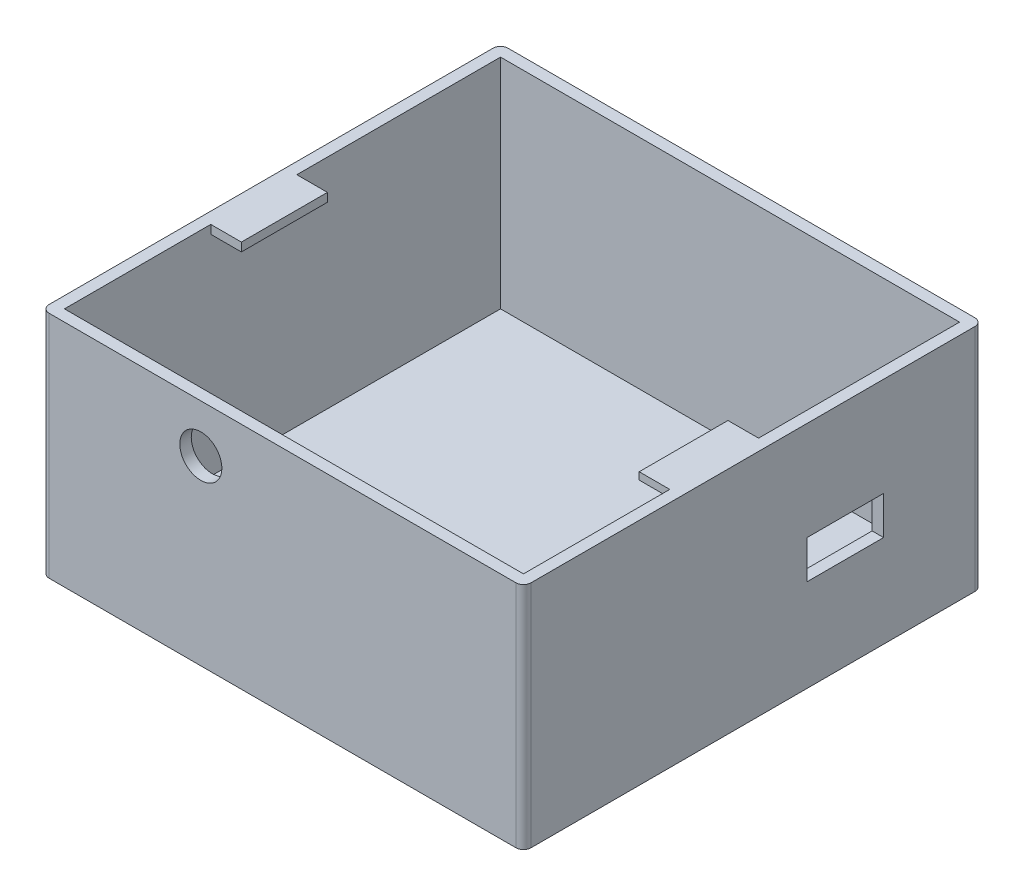
ISO-10303-21;
HEADER;
FILE_DESCRIPTION(('STEP AP214'),'2;1');
FILE_NAME('part.step','',(''),(''),'','','');
FILE_SCHEMA(('AUTOMOTIVE_DESIGN { 1 0 10303 214 1 1 1 1 }'));
ENDSEC;
DATA;
#1=APPLICATION_CONTEXT('core data for automotive mechanical design processes');
#2=APPLICATION_PROTOCOL_DEFINITION('international standard','automotive_design',2000,#1);
#3=PRODUCT_CONTEXT('',#1,'mechanical');
#4=PRODUCT('Part','Part','',(#3));
#5=PRODUCT_RELATED_PRODUCT_CATEGORY('part','',(#4));
#6=PRODUCT_DEFINITION_FORMATION('','',#4);
#7=PRODUCT_DEFINITION_CONTEXT('part definition',#1,'design');
#8=PRODUCT_DEFINITION('design','',#6,#7);
#9=PRODUCT_DEFINITION_SHAPE('','',#8);
#10=(LENGTH_UNIT() NAMED_UNIT(*) SI_UNIT(.MILLI.,.METRE.));
#11=(NAMED_UNIT(*) PLANE_ANGLE_UNIT() SI_UNIT($,.RADIAN.));
#12=(NAMED_UNIT(*) SI_UNIT($,.STERADIAN.) SOLID_ANGLE_UNIT());
#13=UNCERTAINTY_MEASURE_WITH_UNIT(LENGTH_MEASURE(1.E-05),#10,'distance_accuracy_value','');
#14=(GEOMETRIC_REPRESENTATION_CONTEXT(3) GLOBAL_UNCERTAINTY_ASSIGNED_CONTEXT((#13)) GLOBAL_UNIT_ASSIGNED_CONTEXT((#10,
#11,#12)) REPRESENTATION_CONTEXT('',''));
#15=CARTESIAN_POINT('',(0.,0.,0.));
#16=DIRECTION('',(0.,0.,1.));
#17=DIRECTION('',(1.,0.,0.));
#18=AXIS2_PLACEMENT_3D('',#15,#16,#17);
#19=CARTESIAN_POINT('',(38.2849462365592,44.,31.2060931899642));
#20=DIRECTION('',(-1.,0.,0.));
#21=DIRECTION('',(0.,0.,1.));
#22=AXIS2_PLACEMENT_3D('',#19,#20,#21);
#23=PLANE('',#22);
#24=DIRECTION('',(0.,-1.,0.));
#25=VECTOR('',#24,1.);
#26=CARTESIAN_POINT('',(38.2849462365592,44.,-14.3634183953));
#27=LINE('',#26,#25);
#28=CARTESIAN_POINT('',(38.2849462365592,17.0774927134322,-14.3634183953));
#29=VERTEX_POINT('',#28);
#30=CARTESIAN_POINT('',(38.2849462365592,12.0774927134322,-14.3634183953));
#31=VERTEX_POINT('',#30);
#32=EDGE_CURVE('E262',#29,#31,#27,.T.);
#33=ORIENTED_EDGE('',*,*,#32,.F.);
#34=DIRECTION('',(0.,0.,-1.));
#35=VECTOR('',#34,1.);
#36=CARTESIAN_POINT('',(38.2849462365592,17.0774927134322,31.2060931899641));
#37=LINE('',#36,#35);
#38=CARTESIAN_POINT('',(38.2849462365592,17.0774927134322,-4.36341839530005));
#39=VERTEX_POINT('',#38);
#40=EDGE_CURVE('E250',#39,#29,#37,.T.);
#41=ORIENTED_EDGE('',*,*,#40,.F.);
#42=DIRECTION('',(0.,1.,0.));
#43=VECTOR('',#42,1.);
#44=CARTESIAN_POINT('',(38.2849462365592,44.,-4.36341839530004));
#45=LINE('',#44,#43);
#46=CARTESIAN_POINT('',(38.2849462365592,12.0774927134322,-4.36341839530005));
#47=VERTEX_POINT('',#46);
#48=EDGE_CURVE('E225',#47,#39,#45,.T.);
#49=ORIENTED_EDGE('',*,*,#48,.F.);
#50=DIRECTION('',(0.,0.,1.));
#51=VECTOR('',#50,1.);
#52=CARTESIAN_POINT('',(38.2849462365592,12.0774927134322,31.2060931899641));
#53=LINE('',#52,#51);
#54=EDGE_CURVE('E259',#31,#47,#53,.T.);
#55=ORIENTED_EDGE('',*,*,#54,.F.);
#56=EDGE_LOOP('',(#33,#41,#49,#55));
#57=FACE_BOUND('',#56,.T.);
#58=DIRECTION('',(0.,-1.,0.));
#59=VECTOR('',#58,1.);
#60=CARTESIAN_POINT('',(38.2849462365592,44.,-25.7939068100358));
#61=LINE('',#60,#59);
#62=CARTESIAN_POINT('',(38.2849462365592,30.,-25.7939068100358));
#63=VERTEX_POINT('',#62);
#64=CARTESIAN_POINT('',(38.2849462365592,1.5,-25.7939068100358));
#65=VERTEX_POINT('',#64);
#66=EDGE_CURVE('E377',#63,#65,#61,.T.);
#67=ORIENTED_EDGE('',*,*,#66,.T.);
#68=DIRECTION('',(0.,0.,-1.));
#69=VECTOR('',#68,1.);
#70=CARTESIAN_POINT('',(38.2849462365592,1.5,26.2060931899642));
#71=LINE('',#70,#69);
#72=CARTESIAN_POINT('',(38.2849462365592,1.5,26.2060931899642));
#73=VERTEX_POINT('',#72);
#74=EDGE_CURVE('E289',#73,#65,#71,.T.);
#75=ORIENTED_EDGE('',*,*,#74,.F.);
#76=DIRECTION('',(0.,1.,0.));
#77=VECTOR('',#76,1.);
#78=CARTESIAN_POINT('',(38.2849462365592,0.,26.2060931899642));
#79=LINE('',#78,#77);
#80=CARTESIAN_POINT('',(38.2849462365592,0.,26.2060931899642));
#81=VERTEX_POINT('',#80);
#82=EDGE_CURVE('E270',#81,#73,#79,.T.);
#83=ORIENTED_EDGE('',*,*,#82,.F.);
#84=DIRECTION('',(0.,0.,-1.));
#85=VECTOR('',#84,1.);
#86=CARTESIAN_POINT('',(38.2849462365592,0.,31.2060931899642));
#87=LINE('',#86,#85);
#88=CARTESIAN_POINT('',(38.2849462365592,0.,31.2060931899642));
#89=VERTEX_POINT('',#88);
#90=EDGE_CURVE('E373',#89,#81,#87,.T.);
#91=ORIENTED_EDGE('',*,*,#90,.F.);
#92=DIRECTION('',(0.,-1.,0.));
#93=VECTOR('',#92,1.);
#94=CARTESIAN_POINT('',(38.2849462365592,44.,31.2060931899642));
#95=LINE('',#94,#93);
#96=CARTESIAN_POINT('',(38.2849462365592,30.,31.2060931899642));
#97=VERTEX_POINT('',#96);
#98=EDGE_CURVE('E381',#97,#89,#95,.T.);
#99=ORIENTED_EDGE('',*,*,#98,.F.);
#100=DIRECTION('',(0.,0.,1.));
#101=VECTOR('',#100,1.);
#102=CARTESIAN_POINT('',(38.2849462365592,30.,0.));
#103=LINE('',#102,#101);
#104=CARTESIAN_POINT('',(38.2849462365592,30.,12.080480335614));
#105=VERTEX_POINT('',#104);
#106=EDGE_CURVE('E392',#105,#97,#103,.T.);
#107=ORIENTED_EDGE('',*,*,#106,.F.);
#108=DIRECTION('',(0.,1.,0.));
#109=VECTOR('',#108,1.);
#110=CARTESIAN_POINT('',(38.2849462365592,30.,12.080480335614));
#111=LINE('',#110,#109);
#112=CARTESIAN_POINT('',(38.2849462365592,29.0535664679794,12.080480335614));
#113=VERTEX_POINT('',#112);
#114=EDGE_CURVE('E298',#113,#105,#111,.T.);
#115=ORIENTED_EDGE('',*,*,#114,.F.);
#116=DIRECTION('',(0.,0.,1.));
#117=VECTOR('',#116,1.);
#118=CARTESIAN_POINT('',(38.2849462365592,29.0535664679794,0.478112820587739));
#119=LINE('',#118,#117);
#120=CARTESIAN_POINT('',(38.2849462365592,29.0535664679794,0.478112820587739));
#121=VERTEX_POINT('',#120);
#122=EDGE_CURVE('E311',#121,#113,#119,.T.);
#123=ORIENTED_EDGE('',*,*,#122,.F.);
#124=DIRECTION('',(0.,-1.,0.));
#125=VECTOR('',#124,1.);
#126=CARTESIAN_POINT('',(38.2849462365592,30.,0.478112820587739));
#127=LINE('',#126,#125);
#128=CARTESIAN_POINT('',(38.2849462365592,30.,0.478112820587739));
#129=VERTEX_POINT('',#128);
#130=EDGE_CURVE('E292',#129,#121,#127,.T.);
#131=ORIENTED_EDGE('',*,*,#130,.F.);
#132=EDGE_CURVE('E393',#63,#129,#103,.T.);
#133=ORIENTED_EDGE('',*,*,#132,.F.);
#134=EDGE_LOOP('',(#67,#75,#83,#91,#99,#107,#115,#123,#131,#133));
#135=FACE_BOUND('',#134,.T.);
#136=ADVANCED_FACE('F45',(#57,#135),#23,.T.);
#137=CARTESIAN_POINT('',(-21.7150537634408,44.,-25.7939068100358));
#138=DIRECTION('',(1.,0.,0.));
#139=DIRECTION('',(0.,0.,-1.));
#140=AXIS2_PLACEMENT_3D('',#137,#138,#139);
#141=PLANE('',#140);
#142=DIRECTION('',(0.,-1.,0.));
#143=VECTOR('',#142,1.);
#144=CARTESIAN_POINT('',(-21.7150537634408,0.,26.2060931899642));
#145=LINE('',#144,#143);
#146=CARTESIAN_POINT('',(-21.7150537634408,1.49999999999999,26.2060931899642));
#147=VERTEX_POINT('',#146);
#148=CARTESIAN_POINT('',(-21.7150537634408,0.,26.2060931899642));
#149=VERTEX_POINT('',#148);
#150=EDGE_CURVE('E277',#147,#149,#145,.T.);
#151=ORIENTED_EDGE('',*,*,#150,.F.);
#152=DIRECTION('',(0.,0.,-1.));
#153=VECTOR('',#152,1.);
#154=CARTESIAN_POINT('',(-21.7150537634408,1.49999999999999,26.2060931899642));
#155=LINE('',#154,#153);
#156=CARTESIAN_POINT('',(-21.7150537634408,1.49999999999999,-25.7939068100358));
#157=VERTEX_POINT('',#156);
#158=EDGE_CURVE('E283',#147,#157,#155,.T.);
#159=ORIENTED_EDGE('',*,*,#158,.T.);
#160=DIRECTION('',(0.,-1.,0.));
#161=VECTOR('',#160,1.);
#162=CARTESIAN_POINT('',(-21.7150537634408,44.,-25.7939068100358));
#163=LINE('',#162,#161);
#164=CARTESIAN_POINT('',(-21.7150537634408,30.,-25.7939068100358));
#165=VERTEX_POINT('',#164);
#166=EDGE_CURVE('E388',#165,#157,#163,.T.);
#167=ORIENTED_EDGE('',*,*,#166,.F.);
#168=DIRECTION('',(0.,0.,-1.));
#169=VECTOR('',#168,1.);
#170=CARTESIAN_POINT('',(-21.7150537634408,30.,0.));
#171=LINE('',#170,#169);
#172=CARTESIAN_POINT('',(-21.7150537634408,30.,0.832535536043014));
#173=VERTEX_POINT('',#172);
#174=EDGE_CURVE('E401',#173,#165,#171,.T.);
#175=ORIENTED_EDGE('',*,*,#174,.F.);
#176=DIRECTION('',(0.,1.,0.));
#177=VECTOR('',#176,1.);
#178=CARTESIAN_POINT('',(-21.7150537634408,30.,0.832535536043013));
#179=LINE('',#178,#177);
#180=CARTESIAN_POINT('',(-21.7150537634408,28.8791670681405,0.832535536043013));
#181=VERTEX_POINT('',#180);
#182=EDGE_CURVE('E335',#181,#173,#179,.T.);
#183=ORIENTED_EDGE('',*,*,#182,.F.);
#184=DIRECTION('',(0.,0.,-1.));
#185=VECTOR('',#184,1.);
#186=CARTESIAN_POINT('',(-21.7150537634408,28.8791670681405,12.080480335614));
#187=LINE('',#186,#185);
#188=CARTESIAN_POINT('',(-21.7150537634408,28.8791670681405,12.080480335614));
#189=VERTEX_POINT('',#188);
#190=EDGE_CURVE('E348',#189,#181,#187,.T.);
#191=ORIENTED_EDGE('',*,*,#190,.F.);
#192=DIRECTION('',(0.,-1.,0.));
#193=VECTOR('',#192,1.);
#194=CARTESIAN_POINT('',(-21.7150537634408,30.,12.080480335614));
#195=LINE('',#194,#193);
#196=CARTESIAN_POINT('',(-21.7150537634408,30.,12.080480335614));
#197=VERTEX_POINT('',#196);
#198=EDGE_CURVE('E329',#197,#189,#195,.T.);
#199=ORIENTED_EDGE('',*,*,#198,.F.);
#200=CARTESIAN_POINT('',(-21.7150537634408,30.,31.2060931899642));
#201=VERTEX_POINT('',#200);
#202=EDGE_CURVE('E402',#201,#197,#171,.T.);
#203=ORIENTED_EDGE('',*,*,#202,.F.);
#204=DIRECTION('',(0.,-1.,0.));
#205=VECTOR('',#204,1.);
#206=CARTESIAN_POINT('',(-21.7150537634408,44.,31.2060931899642));
#207=LINE('',#206,#205);
#208=CARTESIAN_POINT('',(-21.7150537634408,0.,31.2060931899642));
#209=VERTEX_POINT('',#208);
#210=EDGE_CURVE('E384',#201,#209,#207,.T.);
#211=ORIENTED_EDGE('',*,*,#210,.T.);
#212=DIRECTION('',(0.,0.,1.));
#213=VECTOR('',#212,1.);
#214=CARTESIAN_POINT('',(-21.7150537634408,0.,-25.7939068100358));
#215=LINE('',#214,#213);
#216=EDGE_CURVE('E366',#149,#209,#215,.T.);
#217=ORIENTED_EDGE('',*,*,#216,.F.);
#218=EDGE_LOOP('',(#151,#159,#167,#175,#183,#191,#199,#203,#211,#217));
#219=FACE_BOUND('',#218,.T.);
#220=ADVANCED_FACE('F537',(#219),#141,.T.);
#221=CARTESIAN_POINT('',(38.2849462365592,44.,-25.7939068100358));
#222=DIRECTION('',(0.,0.,1.));
#223=DIRECTION('',(1.,0.,0.));
#224=AXIS2_PLACEMENT_3D('',#221,#222,#223);
#225=PLANE('',#224);
#226=ORIENTED_EDGE('',*,*,#166,.T.);
#227=DIRECTION('',(-1.,0.,0.));
#228=VECTOR('',#227,1.);
#229=CARTESIAN_POINT('',(38.2849462365592,1.5,-25.7939068100358));
#230=LINE('',#229,#228);
#231=EDGE_CURVE('E269',#65,#157,#230,.T.);
#232=ORIENTED_EDGE('',*,*,#231,.F.);
#233=ORIENTED_EDGE('',*,*,#66,.F.);
#234=DIRECTION('',(1.,0.,0.));
#235=VECTOR('',#234,1.);
#236=CARTESIAN_POINT('',(0.,30.,-25.7939068100358));
#237=LINE('',#236,#235);
#238=EDGE_CURVE('E406',#165,#63,#237,.T.);
#239=ORIENTED_EDGE('',*,*,#238,.F.);
#240=EDGE_LOOP('',(#226,#232,#233,#239));
#241=FACE_BOUND('',#240,.T.);
#242=ADVANCED_FACE('F543',(#241),#225,.T.);
#243=CARTESIAN_POINT('',(0.,30.,0.));
#244=DIRECTION('',(0.,1.,0.));
#245=DIRECTION('',(0.,0.,1.));
#246=AXIS2_PLACEMENT_3D('',#243,#244,#245);
#247=PLANE('',#246);
#248=DIRECTION('',(1.,0.,0.));
#249=VECTOR('',#248,1.);
#250=CARTESIAN_POINT('',(-23.2150537634408,30.,32.7060931899642));
#251=LINE('',#250,#249);
#252=CARTESIAN_POINT('',(-22.2150537634408,30.,32.7060931899642));
#253=VERTEX_POINT('',#252);
#254=CARTESIAN_POINT('',(38.7849462365592,30.,32.7060931899642));
#255=VERTEX_POINT('',#254);
#256=EDGE_CURVE('E415',#253,#255,#251,.T.);
#257=ORIENTED_EDGE('',*,*,#256,.T.);
#258=CARTESIAN_POINT('',(38.7849462365592,30.,31.7060931899642));
#259=DIRECTION('',(0.,1.,0.));
#260=DIRECTION('',(0.,0.,1.));
#261=AXIS2_PLACEMENT_3D('',#258,#259,#260);
#262=CIRCLE('',#261,1.);
#263=CARTESIAN_POINT('',(39.7849462365592,30.,31.7060931899642));
#264=VERTEX_POINT('',#263);
#265=EDGE_CURVE('E481',#255,#264,#262,.T.);
#266=ORIENTED_EDGE('',*,*,#265,.T.);
#267=DIRECTION('',(0.,0.,-1.));
#268=VECTOR('',#267,1.);
#269=CARTESIAN_POINT('',(39.7849462365592,30.,-27.2939068100358));
#270=LINE('',#269,#268);
#271=CARTESIAN_POINT('',(39.7849462365592,30.,-26.2939068100358));
#272=VERTEX_POINT('',#271);
#273=EDGE_CURVE('E420',#264,#272,#270,.T.);
#274=ORIENTED_EDGE('',*,*,#273,.T.);
#275=CARTESIAN_POINT('',(38.7849462365592,30.,-26.2939068100358));
#276=DIRECTION('',(0.,1.,0.));
#277=DIRECTION('',(0.,0.,1.));
#278=AXIS2_PLACEMENT_3D('',#275,#276,#277);
#279=CIRCLE('',#278,1.);
#280=CARTESIAN_POINT('',(38.7849462365592,30.,-27.2939068100358));
#281=VERTEX_POINT('',#280);
#282=EDGE_CURVE('E452',#272,#281,#279,.T.);
#283=ORIENTED_EDGE('',*,*,#282,.T.);
#284=DIRECTION('',(-1.,0.,0.));
#285=VECTOR('',#284,1.);
#286=CARTESIAN_POINT('',(-23.2150537634409,30.,-27.2939068100358));
#287=LINE('',#286,#285);
#288=CARTESIAN_POINT('',(-22.2150537634408,30.,-27.2939068100358));
#289=VERTEX_POINT('',#288);
#290=EDGE_CURVE('E423',#281,#289,#287,.T.);
#291=ORIENTED_EDGE('',*,*,#290,.T.);
#292=CARTESIAN_POINT('',(-22.2150537634408,30.,-26.2939068100358));
#293=DIRECTION('',(0.,1.,0.));
#294=DIRECTION('',(0.,0.,1.));
#295=AXIS2_PLACEMENT_3D('',#292,#293,#294);
#296=CIRCLE('',#295,1.);
#297=CARTESIAN_POINT('',(-23.2150537634409,30.,-26.2939068100358));
#298=VERTEX_POINT('',#297);
#299=EDGE_CURVE('E475',#289,#298,#296,.T.);
#300=ORIENTED_EDGE('',*,*,#299,.T.);
#301=DIRECTION('',(0.,0.,1.));
#302=VECTOR('',#301,1.);
#303=CARTESIAN_POINT('',(-23.2150537634409,30.,-27.2939068100358));
#304=LINE('',#303,#302);
#305=CARTESIAN_POINT('',(-23.2150537634408,30.,31.7060931899642));
#306=VERTEX_POINT('',#305);
#307=EDGE_CURVE('E411',#298,#306,#304,.T.);
#308=ORIENTED_EDGE('',*,*,#307,.T.);
#309=CARTESIAN_POINT('',(-22.2150537634408,30.,31.7060931899642));
#310=DIRECTION('',(0.,1.,0.));
#311=DIRECTION('',(0.,0.,1.));
#312=AXIS2_PLACEMENT_3D('',#309,#310,#311);
#313=CIRCLE('',#312,1.);
#314=EDGE_CURVE('E478',#306,#253,#313,.T.);
#315=ORIENTED_EDGE('',*,*,#314,.T.);
#316=EDGE_LOOP('',(#257,#266,#274,#283,#291,#300,#308,#315));
#317=FACE_BOUND('',#316,.T.);
#318=ORIENTED_EDGE('',*,*,#202,.T.);
#319=DIRECTION('',(-1.,0.,0.));
#320=VECTOR('',#319,1.);
#321=CARTESIAN_POINT('',(-17.7150537634408,30.,12.080480335614));
#322=LINE('',#321,#320);
#323=CARTESIAN_POINT('',(-17.7150537634408,30.,12.080480335614));
#324=VERTEX_POINT('',#323);
#325=EDGE_CURVE('E344',#324,#197,#322,.T.);
#326=ORIENTED_EDGE('',*,*,#325,.F.);
#327=DIRECTION('',(0.,0.,1.));
#328=VECTOR('',#327,1.);
#329=CARTESIAN_POINT('',(-17.7150537634408,30.,12.080480335614));
#330=LINE('',#329,#328);
#331=CARTESIAN_POINT('',(-17.7150537634408,30.,0.832535536043013));
#332=VERTEX_POINT('',#331);
#333=EDGE_CURVE('E341',#332,#324,#330,.T.);
#334=ORIENTED_EDGE('',*,*,#333,.F.);
#335=DIRECTION('',(-1.,0.,0.));
#336=VECTOR('',#335,1.);
#337=CARTESIAN_POINT('',(-17.7150537634408,30.,0.832535536043013));
#338=LINE('',#337,#336);
#339=EDGE_CURVE('E356',#332,#173,#338,.T.);
#340=ORIENTED_EDGE('',*,*,#339,.T.);
#341=ORIENTED_EDGE('',*,*,#174,.T.);
#342=ORIENTED_EDGE('',*,*,#238,.T.);
#343=ORIENTED_EDGE('',*,*,#132,.T.);
#344=DIRECTION('',(1.,0.,0.));
#345=VECTOR('',#344,1.);
#346=CARTESIAN_POINT('',(34.2849462365592,30.,0.478112820587739));
#347=LINE('',#346,#345);
#348=CARTESIAN_POINT('',(34.2849462365592,30.,0.478112820587739));
#349=VERTEX_POINT('',#348);
#350=EDGE_CURVE('E307',#349,#129,#347,.T.);
#351=ORIENTED_EDGE('',*,*,#350,.F.);
#352=DIRECTION('',(0.,0.,-1.));
#353=VECTOR('',#352,1.);
#354=CARTESIAN_POINT('',(34.2849462365592,30.,0.478112820587739));
#355=LINE('',#354,#353);
#356=CARTESIAN_POINT('',(34.2849462365592,30.,12.080480335614));
#357=VERTEX_POINT('',#356);
#358=EDGE_CURVE('E304',#357,#349,#355,.T.);
#359=ORIENTED_EDGE('',*,*,#358,.F.);
#360=DIRECTION('',(1.,0.,0.));
#361=VECTOR('',#360,1.);
#362=CARTESIAN_POINT('',(34.2849462365592,30.,12.080480335614));
#363=LINE('',#362,#361);
#364=EDGE_CURVE('E319',#357,#105,#363,.T.);
#365=ORIENTED_EDGE('',*,*,#364,.T.);
#366=ORIENTED_EDGE('',*,*,#106,.T.);
#367=DIRECTION('',(-1.,0.,0.));
#368=VECTOR('',#367,1.);
#369=CARTESIAN_POINT('',(0.,30.,31.2060931899642));
#370=LINE('',#369,#368);
#371=EDGE_CURVE('E397',#97,#201,#370,.T.);
#372=ORIENTED_EDGE('',*,*,#371,.T.);
#373=EDGE_LOOP('',(#318,#326,#334,#340,#341,#342,#343,#351,#359,#365,#366,#372));
#374=FACE_BOUND('',#373,.T.);
#375=ADVANCED_FACE('F498',(#317,#374),#247,.T.);
#376=CARTESIAN_POINT('',(0.,0.,0.));
#377=DIRECTION('',(0.,1.,0.));
#378=DIRECTION('',(0.,0.,1.));
#379=AXIS2_PLACEMENT_3D('',#376,#377,#378);
#380=PLANE('',#379);
#381=DIRECTION('',(1.,0.,0.));
#382=VECTOR('',#381,1.);
#383=CARTESIAN_POINT('',(38.2849462365592,0.,26.2060931899642));
#384=LINE('',#383,#382);
#385=EDGE_CURVE('E280',#149,#81,#384,.T.);
#386=ORIENTED_EDGE('',*,*,#385,.F.);
#387=ORIENTED_EDGE('',*,*,#216,.T.);
#388=DIRECTION('',(1.,0.,0.));
#389=VECTOR('',#388,1.);
#390=CARTESIAN_POINT('',(-21.7150537634408,0.,31.2060931899642));
#391=LINE('',#390,#389);
#392=EDGE_CURVE('E369',#209,#89,#391,.T.);
#393=ORIENTED_EDGE('',*,*,#392,.T.);
#394=ORIENTED_EDGE('',*,*,#90,.T.);
#395=EDGE_LOOP('',(#386,#387,#393,#394));
#396=FACE_BOUND('',#395,.T.);
#397=DIRECTION('',(0.,0.,-1.));
#398=VECTOR('',#397,1.);
#399=CARTESIAN_POINT('',(39.7849462365592,0.,-27.2939068100358));
#400=LINE('',#399,#398);
#401=CARTESIAN_POINT('',(39.7849462365592,0.,31.7060931899642));
#402=VERTEX_POINT('',#401);
#403=CARTESIAN_POINT('',(39.7849462365592,0.,-26.2939068100358));
#404=VERTEX_POINT('',#403);
#405=EDGE_CURVE('E435',#402,#404,#400,.T.);
#406=ORIENTED_EDGE('',*,*,#405,.F.);
#407=CARTESIAN_POINT('',(38.7849462365592,0.,31.7060931899642));
#408=DIRECTION('',(0.,1.,0.));
#409=DIRECTION('',(0.,0.,1.));
#410=AXIS2_PLACEMENT_3D('',#407,#408,#409);
#411=CIRCLE('',#410,1.);
#412=CARTESIAN_POINT('',(38.7849462365592,0.,32.7060931899642));
#413=VERTEX_POINT('',#412);
#414=EDGE_CURVE('E465',#402,#413,#411,.F.);
#415=ORIENTED_EDGE('',*,*,#414,.T.);
#416=DIRECTION('',(1.,0.,0.));
#417=VECTOR('',#416,1.);
#418=CARTESIAN_POINT('',(-23.2150537634408,0.,32.7060931899642));
#419=LINE('',#418,#417);
#420=CARTESIAN_POINT('',(-22.2150537634408,0.,32.7060931899642));
#421=VERTEX_POINT('',#420);
#422=EDGE_CURVE('E431',#421,#413,#419,.T.);
#423=ORIENTED_EDGE('',*,*,#422,.F.);
#424=CARTESIAN_POINT('',(-22.2150537634408,0.,31.7060931899642));
#425=DIRECTION('',(0.,1.,0.));
#426=DIRECTION('',(0.,0.,1.));
#427=AXIS2_PLACEMENT_3D('',#424,#425,#426);
#428=CIRCLE('',#427,1.);
#429=CARTESIAN_POINT('',(-23.2150537634408,0.,31.7060931899642));
#430=VERTEX_POINT('',#429);
#431=EDGE_CURVE('E462',#421,#430,#428,.F.);
#432=ORIENTED_EDGE('',*,*,#431,.T.);
#433=DIRECTION('',(0.,0.,1.));
#434=VECTOR('',#433,1.);
#435=CARTESIAN_POINT('',(-23.2150537634409,0.,-27.2939068100358));
#436=LINE('',#435,#434);
#437=CARTESIAN_POINT('',(-23.2150537634409,0.,-26.2939068100358));
#438=VERTEX_POINT('',#437);
#439=EDGE_CURVE('E410',#438,#430,#436,.T.);
#440=ORIENTED_EDGE('',*,*,#439,.F.);
#441=CARTESIAN_POINT('',(-22.2150537634408,0.,-26.2939068100358));
#442=DIRECTION('',(0.,1.,0.));
#443=DIRECTION('',(0.,0.,1.));
#444=AXIS2_PLACEMENT_3D('',#441,#442,#443);
#445=CIRCLE('',#444,1.);
#446=CARTESIAN_POINT('',(-22.2150537634408,0.,-27.2939068100358));
#447=VERTEX_POINT('',#446);
#448=EDGE_CURVE('E459',#438,#447,#445,.F.);
#449=ORIENTED_EDGE('',*,*,#448,.T.);
#450=DIRECTION('',(-1.,0.,0.));
#451=VECTOR('',#450,1.);
#452=CARTESIAN_POINT('',(-23.2150537634409,0.,-27.2939068100358));
#453=LINE('',#452,#451);
#454=CARTESIAN_POINT('',(38.7849462365592,0.,-27.2939068100358));
#455=VERTEX_POINT('',#454);
#456=EDGE_CURVE('E416',#455,#447,#453,.T.);
#457=ORIENTED_EDGE('',*,*,#456,.F.);
#458=CARTESIAN_POINT('',(38.7849462365592,0.,-26.2939068100358));
#459=DIRECTION('',(0.,1.,0.));
#460=DIRECTION('',(0.,0.,1.));
#461=AXIS2_PLACEMENT_3D('',#458,#459,#460);
#462=CIRCLE('',#461,1.);
#463=EDGE_CURVE('E444',#455,#404,#462,.F.);
#464=ORIENTED_EDGE('',*,*,#463,.T.);
#465=EDGE_LOOP('',(#406,#415,#423,#432,#440,#449,#457,#464));
#466=FACE_BOUND('',#465,.T.);
#467=ADVANCED_FACE('F510',(#396,#466),#380,.F.);
#468=CARTESIAN_POINT('',(-23.2150537634409,30.,-27.2939068100358));
#469=DIRECTION('',(1.,0.,0.));
#470=DIRECTION('',(0.,0.,-1.));
#471=AXIS2_PLACEMENT_3D('',#468,#469,#470);
#472=PLANE('',#471);
#473=ORIENTED_EDGE('',*,*,#439,.T.);
#474=DIRECTION('',(0.,-1.,0.));
#475=VECTOR('',#474,1.);
#476=CARTESIAN_POINT('',(-23.2150537634408,30.,31.7060931899642));
#477=LINE('',#476,#475);
#478=EDGE_CURVE('E55',#430,#306,#477,.F.);
#479=ORIENTED_EDGE('',*,*,#478,.T.);
#480=ORIENTED_EDGE('',*,*,#307,.F.);
#481=DIRECTION('',(0.,-1.,0.));
#482=VECTOR('',#481,1.);
#483=CARTESIAN_POINT('',(-23.2150537634409,30.,-26.2939068100358));
#484=LINE('',#483,#482);
#485=EDGE_CURVE('E484',#298,#438,#484,.T.);
#486=ORIENTED_EDGE('',*,*,#485,.T.);
#487=EDGE_LOOP('',(#473,#479,#480,#486));
#488=FACE_BOUND('',#487,.T.);
#489=ADVANCED_FACE('F492',(#488),#472,.F.);
#490=CARTESIAN_POINT('',(-23.2150537634408,30.,32.7060931899642));
#491=DIRECTION('',(0.,0.,-1.));
#492=DIRECTION('',(-1.,0.,0.));
#493=AXIS2_PLACEMENT_3D('',#490,#491,#492);
#494=PLANE('',#493);
#495=CARTESIAN_POINT('',(-2.3916441057148,23.7450753484463,32.7060931899642));
#496=DIRECTION('',(0.,0.,-1.));
#497=DIRECTION('',(-1.,0.,0.));
#498=AXIS2_PLACEMENT_3D('',#495,#496,#497);
#499=CIRCLE('',#498,2.75);
#500=CARTESIAN_POINT('',(-5.1416441057148,23.7450753484463,32.7060931899642));
#501=VERTEX_POINT('',#500);
#502=EDGE_CURVE('E265',#501,#501,#499,.T.);
#503=ORIENTED_EDGE('',*,*,#502,.T.);
#504=EDGE_LOOP('',(#503));
#505=FACE_BOUND('',#504,.T.);
#506=ORIENTED_EDGE('',*,*,#422,.T.);
#507=DIRECTION('',(0.,-1.,0.));
#508=VECTOR('',#507,1.);
#509=CARTESIAN_POINT('',(38.7849462365592,30.,32.7060931899642));
#510=LINE('',#509,#508);
#511=EDGE_CURVE('E472',#413,#255,#510,.F.);
#512=ORIENTED_EDGE('',*,*,#511,.T.);
#513=ORIENTED_EDGE('',*,*,#256,.F.);
#514=DIRECTION('',(0.,-1.,0.));
#515=VECTOR('',#514,1.);
#516=CARTESIAN_POINT('',(-22.2150537634408,30.,32.7060931899642));
#517=LINE('',#516,#515);
#518=EDGE_CURVE('E468',#253,#421,#517,.T.);
#519=ORIENTED_EDGE('',*,*,#518,.T.);
#520=EDGE_LOOP('',(#506,#512,#513,#519));
#521=FACE_BOUND('',#520,.T.);
#522=ADVANCED_FACE('F506',(#505,#521),#494,.F.);
#523=CARTESIAN_POINT('',(39.7849462365592,30.,-27.2939068100358));
#524=DIRECTION('',(-1.,0.,0.));
#525=DIRECTION('',(0.,0.,1.));
#526=AXIS2_PLACEMENT_3D('',#523,#524,#525);
#527=PLANE('',#526);
#528=DIRECTION('',(0.,0.,1.));
#529=VECTOR('',#528,1.);
#530=CARTESIAN_POINT('',(39.7849462365592,17.0774927134322,-14.3634183953));
#531=LINE('',#530,#529);
#532=CARTESIAN_POINT('',(39.7849462365592,17.0774927134322,-14.3634183953));
#533=VERTEX_POINT('',#532);
#534=CARTESIAN_POINT('',(39.7849462365592,17.0774927134322,-4.36341839530005));
#535=VERTEX_POINT('',#534);
#536=EDGE_CURVE('E232',#533,#535,#531,.T.);
#537=ORIENTED_EDGE('',*,*,#536,.F.);
#538=DIRECTION('',(0.,1.,0.));
#539=VECTOR('',#538,1.);
#540=CARTESIAN_POINT('',(39.7849462365592,12.0774927134322,-14.3634183953));
#541=LINE('',#540,#539);
#542=CARTESIAN_POINT('',(39.7849462365592,12.0774927134322,-14.3634183953));
#543=VERTEX_POINT('',#542);
#544=EDGE_CURVE('E70',#543,#533,#541,.T.);
#545=ORIENTED_EDGE('',*,*,#544,.F.);
#546=DIRECTION('',(0.,0.,-1.));
#547=VECTOR('',#546,1.);
#548=CARTESIAN_POINT('',(39.7849462365592,12.0774927134322,-14.3634183953));
#549=LINE('',#548,#547);
#550=CARTESIAN_POINT('',(39.7849462365592,12.0774927134322,-4.36341839530005));
#551=VERTEX_POINT('',#550);
#552=EDGE_CURVE('E240',#551,#543,#549,.T.);
#553=ORIENTED_EDGE('',*,*,#552,.F.);
#554=DIRECTION('',(0.,-1.,0.));
#555=VECTOR('',#554,1.);
#556=CARTESIAN_POINT('',(39.7849462365592,12.0774927134322,-4.36341839530005));
#557=LINE('',#556,#555);
#558=EDGE_CURVE('E222',#535,#551,#557,.T.);
#559=ORIENTED_EDGE('',*,*,#558,.F.);
#560=EDGE_LOOP('',(#537,#545,#553,#559));
#561=FACE_BOUND('',#560,.T.);
#562=ORIENTED_EDGE('',*,*,#273,.F.);
#563=DIRECTION('',(0.,-1.,0.));
#564=VECTOR('',#563,1.);
#565=CARTESIAN_POINT('',(39.7849462365592,30.,31.7060931899642));
#566=LINE('',#565,#564);
#567=EDGE_CURVE('E455',#264,#402,#566,.T.);
#568=ORIENTED_EDGE('',*,*,#567,.T.);
#569=ORIENTED_EDGE('',*,*,#405,.T.);
#570=DIRECTION('',(0.,-1.,0.));
#571=VECTOR('',#570,1.);
#572=CARTESIAN_POINT('',(39.7849462365592,30.,-26.2939068100358));
#573=LINE('',#572,#571);
#574=EDGE_CURVE('E448',#404,#272,#573,.F.);
#575=ORIENTED_EDGE('',*,*,#574,.T.);
#576=EDGE_LOOP('',(#562,#568,#569,#575));
#577=FACE_BOUND('',#576,.T.);
#578=ADVANCED_FACE('F237',(#561,#577),#527,.F.);
#579=CARTESIAN_POINT('',(-23.2150537634409,30.,-27.2939068100358));
#580=DIRECTION('',(0.,0.,1.));
#581=DIRECTION('',(1.,0.,0.));
#582=AXIS2_PLACEMENT_3D('',#579,#580,#581);
#583=PLANE('',#582);
#584=ORIENTED_EDGE('',*,*,#456,.T.);
#585=DIRECTION('',(0.,-1.,0.));
#586=VECTOR('',#585,1.);
#587=CARTESIAN_POINT('',(-22.2150537634408,30.,-27.2939068100358));
#588=LINE('',#587,#586);
#589=EDGE_CURVE('E11',#447,#289,#588,.F.);
#590=ORIENTED_EDGE('',*,*,#589,.T.);
#591=ORIENTED_EDGE('',*,*,#290,.F.);
#592=DIRECTION('',(0.,-1.,0.));
#593=VECTOR('',#592,1.);
#594=CARTESIAN_POINT('',(38.7849462365592,30.,-27.2939068100358));
#595=LINE('',#594,#593);
#596=EDGE_CURVE('E427',#281,#455,#595,.T.);
#597=ORIENTED_EDGE('',*,*,#596,.T.);
#598=EDGE_LOOP('',(#584,#590,#591,#597));
#599=FACE_BOUND('',#598,.T.);
#600=ADVANCED_FACE('F522',(#599),#583,.F.);
#601=CARTESIAN_POINT('',(-21.7150537634408,44.,31.2060931899642));
#602=DIRECTION('',(0.,0.,-1.));
#603=DIRECTION('',(-1.,0.,0.));
#604=AXIS2_PLACEMENT_3D('',#601,#602,#603);
#605=PLANE('',#604);
#606=CARTESIAN_POINT('',(-2.3916441057148,23.7450753484463,31.2060931899642));
#607=DIRECTION('',(0.,0.,-1.));
#608=DIRECTION('',(-1.,0.,0.));
#609=AXIS2_PLACEMENT_3D('',#606,#607,#608);
#610=CIRCLE('',#609,2.75);
#611=CARTESIAN_POINT('',(-5.1416441057148,23.7450753484463,31.2060931899642));
#612=VERTEX_POINT('',#611);
#613=EDGE_CURVE('E49',#612,#612,#610,.T.);
#614=ORIENTED_EDGE('',*,*,#613,.F.);
#615=EDGE_LOOP('',(#614));
#616=FACE_BOUND('',#615,.T.);
#617=ORIENTED_EDGE('',*,*,#98,.T.);
#618=ORIENTED_EDGE('',*,*,#392,.F.);
#619=ORIENTED_EDGE('',*,*,#210,.F.);
#620=ORIENTED_EDGE('',*,*,#371,.F.);
#621=EDGE_LOOP('',(#617,#618,#619,#620));
#622=FACE_BOUND('',#621,.T.);
#623=ADVANCED_FACE('F550',(#616,#622),#605,.T.);
#624=CARTESIAN_POINT('',(38.7849462365592,30.,-26.2939068100358));
#625=DIRECTION('',(0.,-1.,0.));
#626=DIRECTION('',(0.,0.,-1.));
#627=AXIS2_PLACEMENT_3D('',#624,#625,#626);
#628=CYLINDRICAL_SURFACE('',#627,1.);
#629=ORIENTED_EDGE('',*,*,#282,.F.);
#630=ORIENTED_EDGE('',*,*,#574,.F.);
#631=ORIENTED_EDGE('',*,*,#463,.F.);
#632=ORIENTED_EDGE('',*,*,#596,.F.);
#633=EDGE_LOOP('',(#629,#630,#631,#632));
#634=FACE_BOUND('',#633,.T.);
#635=ADVANCED_FACE('F525',(#634),#628,.T.);
#636=CARTESIAN_POINT('',(38.7849462365592,30.,31.7060931899642));
#637=DIRECTION('',(0.,-1.,0.));
#638=DIRECTION('',(0.,0.,-1.));
#639=AXIS2_PLACEMENT_3D('',#636,#637,#638);
#640=CYLINDRICAL_SURFACE('',#639,1.);
#641=ORIENTED_EDGE('',*,*,#265,.F.);
#642=ORIENTED_EDGE('',*,*,#511,.F.);
#643=ORIENTED_EDGE('',*,*,#414,.F.);
#644=ORIENTED_EDGE('',*,*,#567,.F.);
#645=EDGE_LOOP('',(#641,#642,#643,#644));
#646=FACE_BOUND('',#645,.T.);
#647=ADVANCED_FACE('F514',(#646),#640,.T.);
#648=CARTESIAN_POINT('',(-22.2150537634408,30.,31.7060931899642));
#649=DIRECTION('',(0.,-1.,0.));
#650=DIRECTION('',(0.,0.,-1.));
#651=AXIS2_PLACEMENT_3D('',#648,#649,#650);
#652=CYLINDRICAL_SURFACE('',#651,1.);
#653=ORIENTED_EDGE('',*,*,#314,.F.);
#654=ORIENTED_EDGE('',*,*,#478,.F.);
#655=ORIENTED_EDGE('',*,*,#431,.F.);
#656=ORIENTED_EDGE('',*,*,#518,.F.);
#657=EDGE_LOOP('',(#653,#654,#655,#656));
#658=FACE_BOUND('',#657,.T.);
#659=ADVANCED_FACE('F503',(#658),#652,.T.);
#660=CARTESIAN_POINT('',(-22.2150537634408,30.,-26.2939068100358));
#661=DIRECTION('',(0.,-1.,0.));
#662=DIRECTION('',(0.,0.,-1.));
#663=AXIS2_PLACEMENT_3D('',#660,#661,#662);
#664=CYLINDRICAL_SURFACE('',#663,1.);
#665=ORIENTED_EDGE('',*,*,#299,.F.);
#666=ORIENTED_EDGE('',*,*,#589,.F.);
#667=ORIENTED_EDGE('',*,*,#448,.F.);
#668=ORIENTED_EDGE('',*,*,#485,.F.);
#669=EDGE_LOOP('',(#665,#666,#667,#668));
#670=FACE_BOUND('',#669,.T.);
#671=ADVANCED_FACE('F47',(#670),#664,.T.);
#672=CARTESIAN_POINT('',(-17.7150537634408,30.,12.080480335614));
#673=DIRECTION('',(0.,0.,-1.));
#674=DIRECTION('',(-1.,0.,0.));
#675=AXIS2_PLACEMENT_3D('',#672,#673,#674);
#676=PLANE('',#675);
#677=ORIENTED_EDGE('',*,*,#198,.T.);
#678=DIRECTION('',(-1.,0.,0.));
#679=VECTOR('',#678,1.);
#680=CARTESIAN_POINT('',(-17.7150537634408,28.8791670681405,12.080480335614));
#681=LINE('',#680,#679);
#682=CARTESIAN_POINT('',(-17.7150537634408,28.8791670681405,12.080480335614));
#683=VERTEX_POINT('',#682);
#684=EDGE_CURVE('E363',#683,#189,#681,.T.);
#685=ORIENTED_EDGE('',*,*,#684,.F.);
#686=DIRECTION('',(0.,-1.,0.));
#687=VECTOR('',#686,1.);
#688=CARTESIAN_POINT('',(-17.7150537634408,30.,12.080480335614));
#689=LINE('',#688,#687);
#690=EDGE_CURVE('E330',#324,#683,#689,.T.);
#691=ORIENTED_EDGE('',*,*,#690,.F.);
#692=ORIENTED_EDGE('',*,*,#325,.T.);
#693=EDGE_LOOP('',(#677,#685,#691,#692));
#694=FACE_BOUND('',#693,.T.);
#695=ADVANCED_FACE('F528',(#694),#676,.F.);
#696=CARTESIAN_POINT('',(-17.7150537634408,28.8791670681405,12.080480335614));
#697=DIRECTION('',(0.,1.,0.));
#698=DIRECTION('',(0.,0.,1.));
#699=AXIS2_PLACEMENT_3D('',#696,#697,#698);
#700=PLANE('',#699);
#701=ORIENTED_EDGE('',*,*,#190,.T.);
#702=DIRECTION('',(-1.,0.,0.));
#703=VECTOR('',#702,1.);
#704=CARTESIAN_POINT('',(-17.7150537634408,28.8791670681405,0.832535536043013));
#705=LINE('',#704,#703);
#706=CARTESIAN_POINT('',(-17.7150537634408,28.8791670681405,0.832535536043013));
#707=VERTEX_POINT('',#706);
#708=EDGE_CURVE('E359',#707,#181,#705,.T.);
#709=ORIENTED_EDGE('',*,*,#708,.F.);
#710=DIRECTION('',(0.,0.,-1.));
#711=VECTOR('',#710,1.);
#712=CARTESIAN_POINT('',(-17.7150537634408,28.8791670681405,12.080480335614));
#713=LINE('',#712,#711);
#714=EDGE_CURVE('E334',#683,#707,#713,.T.);
#715=ORIENTED_EDGE('',*,*,#714,.F.);
#716=ORIENTED_EDGE('',*,*,#684,.T.);
#717=EDGE_LOOP('',(#701,#709,#715,#716));
#718=FACE_BOUND('',#717,.T.);
#719=ADVANCED_FACE('F533',(#718),#700,.F.);
#720=CARTESIAN_POINT('',(-17.7150537634408,30.,0.832535536043013));
#721=DIRECTION('',(0.,0.,1.));
#722=DIRECTION('',(1.,0.,0.));
#723=AXIS2_PLACEMENT_3D('',#720,#721,#722);
#724=PLANE('',#723);
#725=ORIENTED_EDGE('',*,*,#182,.T.);
#726=ORIENTED_EDGE('',*,*,#339,.F.);
#727=DIRECTION('',(0.,1.,0.));
#728=VECTOR('',#727,1.);
#729=CARTESIAN_POINT('',(-17.7150537634408,30.,0.832535536043013));
#730=LINE('',#729,#728);
#731=EDGE_CURVE('E338',#707,#332,#730,.T.);
#732=ORIENTED_EDGE('',*,*,#731,.F.);
#733=ORIENTED_EDGE('',*,*,#708,.T.);
#734=EDGE_LOOP('',(#725,#726,#732,#733));
#735=FACE_BOUND('',#734,.T.);
#736=ADVANCED_FACE('F606',(#735),#724,.F.);
#737=CARTESIAN_POINT('',(-17.7150537634408,0.,0.));
#738=DIRECTION('',(1.,0.,0.));
#739=DIRECTION('',(0.,0.,-1.));
#740=AXIS2_PLACEMENT_3D('',#737,#738,#739);
#741=PLANE('',#740);
#742=ORIENTED_EDGE('',*,*,#690,.T.);
#743=ORIENTED_EDGE('',*,*,#714,.T.);
#744=ORIENTED_EDGE('',*,*,#731,.T.);
#745=ORIENTED_EDGE('',*,*,#333,.T.);
#746=EDGE_LOOP('',(#742,#743,#744,#745));
#747=FACE_BOUND('',#746,.T.);
#748=ADVANCED_FACE('F616',(#747),#741,.T.);
#749=CARTESIAN_POINT('',(34.2849462365592,30.,0.478112820587739));
#750=DIRECTION('',(0.,0.,1.));
#751=DIRECTION('',(1.,0.,0.));
#752=AXIS2_PLACEMENT_3D('',#749,#750,#751);
#753=PLANE('',#752);
#754=ORIENTED_EDGE('',*,*,#130,.T.);
#755=DIRECTION('',(1.,0.,0.));
#756=VECTOR('',#755,1.);
#757=CARTESIAN_POINT('',(34.2849462365592,29.0535664679794,0.478112820587739));
#758=LINE('',#757,#756);
#759=CARTESIAN_POINT('',(34.2849462365592,29.0535664679794,0.478112820587739));
#760=VERTEX_POINT('',#759);
#761=EDGE_CURVE('E326',#760,#121,#758,.T.);
#762=ORIENTED_EDGE('',*,*,#761,.F.);
#763=DIRECTION('',(0.,-1.,0.));
#764=VECTOR('',#763,1.);
#765=CARTESIAN_POINT('',(34.2849462365592,30.,0.478112820587739));
#766=LINE('',#765,#764);
#767=EDGE_CURVE('E293',#349,#760,#766,.T.);
#768=ORIENTED_EDGE('',*,*,#767,.F.);
#769=ORIENTED_EDGE('',*,*,#350,.T.);
#770=EDGE_LOOP('',(#754,#762,#768,#769));
#771=FACE_BOUND('',#770,.T.);
#772=ADVANCED_FACE('F627',(#771),#753,.F.);
#773=CARTESIAN_POINT('',(34.2849462365592,29.0535664679794,0.478112820587739));
#774=DIRECTION('',(0.,1.,0.));
#775=DIRECTION('',(0.,0.,1.));
#776=AXIS2_PLACEMENT_3D('',#773,#774,#775);
#777=PLANE('',#776);
#778=ORIENTED_EDGE('',*,*,#122,.T.);
#779=DIRECTION('',(1.,0.,0.));
#780=VECTOR('',#779,1.);
#781=CARTESIAN_POINT('',(34.2849462365592,29.0535664679794,12.080480335614));
#782=LINE('',#781,#780);
#783=CARTESIAN_POINT('',(34.2849462365592,29.0535664679794,12.080480335614));
#784=VERTEX_POINT('',#783);
#785=EDGE_CURVE('E322',#784,#113,#782,.T.);
#786=ORIENTED_EDGE('',*,*,#785,.F.);
#787=DIRECTION('',(0.,0.,1.));
#788=VECTOR('',#787,1.);
#789=CARTESIAN_POINT('',(34.2849462365592,29.0535664679794,0.478112820587739));
#790=LINE('',#789,#788);
#791=EDGE_CURVE('E297',#760,#784,#790,.T.);
#792=ORIENTED_EDGE('',*,*,#791,.F.);
#793=ORIENTED_EDGE('',*,*,#761,.T.);
#794=EDGE_LOOP('',(#778,#786,#792,#793));
#795=FACE_BOUND('',#794,.T.);
#796=ADVANCED_FACE('F644',(#795),#777,.F.);
#797=CARTESIAN_POINT('',(34.2849462365592,30.,12.080480335614));
#798=DIRECTION('',(0.,0.,-1.));
#799=DIRECTION('',(-1.,0.,0.));
#800=AXIS2_PLACEMENT_3D('',#797,#798,#799);
#801=PLANE('',#800);
#802=ORIENTED_EDGE('',*,*,#114,.T.);
#803=ORIENTED_EDGE('',*,*,#364,.F.);
#804=DIRECTION('',(0.,1.,0.));
#805=VECTOR('',#804,1.);
#806=CARTESIAN_POINT('',(34.2849462365592,30.,12.080480335614));
#807=LINE('',#806,#805);
#808=EDGE_CURVE('E301',#784,#357,#807,.T.);
#809=ORIENTED_EDGE('',*,*,#808,.F.);
#810=ORIENTED_EDGE('',*,*,#785,.T.);
#811=EDGE_LOOP('',(#802,#803,#809,#810));
#812=FACE_BOUND('',#811,.T.);
#813=ADVANCED_FACE('F655',(#812),#801,.F.);
#814=CARTESIAN_POINT('',(34.2849462365592,0.,0.));
#815=DIRECTION('',(-1.,0.,0.));
#816=DIRECTION('',(0.,0.,1.));
#817=AXIS2_PLACEMENT_3D('',#814,#815,#816);
#818=PLANE('',#817);
#819=ORIENTED_EDGE('',*,*,#767,.T.);
#820=ORIENTED_EDGE('',*,*,#791,.T.);
#821=ORIENTED_EDGE('',*,*,#808,.T.);
#822=ORIENTED_EDGE('',*,*,#358,.T.);
#823=EDGE_LOOP('',(#819,#820,#821,#822));
#824=FACE_BOUND('',#823,.T.);
#825=ADVANCED_FACE('F666',(#824),#818,.T.);
#826=CARTESIAN_POINT('',(38.2849462365592,1.5,26.2060931899642));
#827=DIRECTION('',(0.,-1.,0.));
#828=DIRECTION('',(1.,0.,0.));
#829=AXIS2_PLACEMENT_3D('',#826,#827,#828);
#830=PLANE('',#829);
#831=ORIENTED_EDGE('',*,*,#231,.T.);
#832=ORIENTED_EDGE('',*,*,#158,.F.);
#833=DIRECTION('',(-1.,0.,0.));
#834=VECTOR('',#833,1.);
#835=CARTESIAN_POINT('',(38.2849462365592,1.5,26.2060931899642));
#836=LINE('',#835,#834);
#837=EDGE_CURVE('E274',#73,#147,#836,.T.);
#838=ORIENTED_EDGE('',*,*,#837,.F.);
#839=ORIENTED_EDGE('',*,*,#74,.T.);
#840=EDGE_LOOP('',(#831,#832,#838,#839));
#841=FACE_BOUND('',#840,.T.);
#842=ADVANCED_FACE('F677',(#841),#830,.F.);
#843=CARTESIAN_POINT('',(0.,0.,26.2060931899642));
#844=DIRECTION('',(0.,0.,1.));
#845=DIRECTION('',(1.,0.,0.));
#846=AXIS2_PLACEMENT_3D('',#843,#844,#845);
#847=PLANE('',#846);
#848=ORIENTED_EDGE('',*,*,#82,.T.);
#849=ORIENTED_EDGE('',*,*,#837,.T.);
#850=ORIENTED_EDGE('',*,*,#150,.T.);
#851=ORIENTED_EDGE('',*,*,#385,.T.);
#852=EDGE_LOOP('',(#848,#849,#850,#851));
#853=FACE_BOUND('',#852,.T.);
#854=ADVANCED_FACE('F709',(#853),#847,.T.);
#855=CARTESIAN_POINT('',(-2.3916441057148,23.7450753484463,12.7060931899642));
#856=DIRECTION('',(0.,0.,1.));
#857=DIRECTION('',(1.,0.,0.));
#858=AXIS2_PLACEMENT_3D('',#855,#856,#857);
#859=CYLINDRICAL_SURFACE('',#858,2.75);
#860=ORIENTED_EDGE('',*,*,#613,.T.);
#861=EDGE_LOOP('',(#860));
#862=FACE_BOUND('',#861,.T.);
#863=ORIENTED_EDGE('',*,*,#502,.F.);
#864=EDGE_LOOP('',(#863));
#865=FACE_BOUND('',#864,.T.);
#866=ADVANCED_FACE('F720',(#862,#865),#859,.F.);
#867=CARTESIAN_POINT('',(24.7849462365591,12.0774927134322,-14.3634183953));
#868=DIRECTION('',(0.,0.,-1.));
#869=DIRECTION('',(-1.,0.,0.));
#870=AXIS2_PLACEMENT_3D('',#867,#868,#869);
#871=PLANE('',#870);
#872=ORIENTED_EDGE('',*,*,#32,.T.);
#873=DIRECTION('',(1.,0.,0.));
#874=VECTOR('',#873,1.);
#875=CARTESIAN_POINT('',(24.7849462365591,12.0774927134322,-14.3634183953));
#876=LINE('',#875,#874);
#877=EDGE_CURVE('E247',#31,#543,#876,.T.);
#878=ORIENTED_EDGE('',*,*,#877,.T.);
#879=ORIENTED_EDGE('',*,*,#544,.T.);
#880=DIRECTION('',(1.,0.,0.));
#881=VECTOR('',#880,1.);
#882=CARTESIAN_POINT('',(24.7849462365591,17.0774927134322,-14.3634183953));
#883=LINE('',#882,#881);
#884=EDGE_CURVE('E229',#29,#533,#883,.T.);
#885=ORIENTED_EDGE('',*,*,#884,.F.);
#886=EDGE_LOOP('',(#872,#878,#879,#885));
#887=FACE_BOUND('',#886,.T.);
#888=ADVANCED_FACE('F748',(#887),#871,.F.);
#889=CARTESIAN_POINT('',(24.7849462365591,12.0774927134322,-14.3634183953));
#890=DIRECTION('',(0.,-1.,0.));
#891=DIRECTION('',(0.,0.,-1.));
#892=AXIS2_PLACEMENT_3D('',#889,#890,#891);
#893=PLANE('',#892);
#894=ORIENTED_EDGE('',*,*,#54,.T.);
#895=DIRECTION('',(1.,0.,0.));
#896=VECTOR('',#895,1.);
#897=CARTESIAN_POINT('',(24.7849462365591,12.0774927134322,-4.36341839530005));
#898=LINE('',#897,#896);
#899=EDGE_CURVE('E228',#47,#551,#898,.T.);
#900=ORIENTED_EDGE('',*,*,#899,.T.);
#901=ORIENTED_EDGE('',*,*,#552,.T.);
#902=ORIENTED_EDGE('',*,*,#877,.F.);
#903=EDGE_LOOP('',(#894,#900,#901,#902));
#904=FACE_BOUND('',#903,.T.);
#905=ADVANCED_FACE('F771',(#904),#893,.F.);
#906=CARTESIAN_POINT('',(24.7849462365591,12.0774927134322,-4.36341839530005));
#907=DIRECTION('',(0.,0.,1.));
#908=DIRECTION('',(1.,0.,0.));
#909=AXIS2_PLACEMENT_3D('',#906,#907,#908);
#910=PLANE('',#909);
#911=ORIENTED_EDGE('',*,*,#48,.T.);
#912=DIRECTION('',(1.,0.,0.));
#913=VECTOR('',#912,1.);
#914=CARTESIAN_POINT('',(24.7849462365591,17.0774927134322,-4.36341839530005));
#915=LINE('',#914,#913);
#916=EDGE_CURVE('E62',#39,#535,#915,.T.);
#917=ORIENTED_EDGE('',*,*,#916,.T.);
#918=ORIENTED_EDGE('',*,*,#558,.T.);
#919=ORIENTED_EDGE('',*,*,#899,.F.);
#920=EDGE_LOOP('',(#911,#917,#918,#919));
#921=FACE_BOUND('',#920,.T.);
#922=ADVANCED_FACE('F219',(#921),#910,.F.);
#923=CARTESIAN_POINT('',(24.7849462365591,17.0774927134322,-14.3634183953));
#924=DIRECTION('',(0.,1.,0.));
#925=DIRECTION('',(0.,0.,1.));
#926=AXIS2_PLACEMENT_3D('',#923,#924,#925);
#927=PLANE('',#926);
#928=ORIENTED_EDGE('',*,*,#40,.T.);
#929=ORIENTED_EDGE('',*,*,#884,.T.);
#930=ORIENTED_EDGE('',*,*,#536,.T.);
#931=ORIENTED_EDGE('',*,*,#916,.F.);
#932=EDGE_LOOP('',(#928,#929,#930,#931));
#933=FACE_BOUND('',#932,.T.);
#934=ADVANCED_FACE('F233',(#933),#927,.F.);
#935=CLOSED_SHELL('',(#136,#220,#242,#375,#467,#489,#522,#578,#600,#623,#635,#647,#659,#671,
#695,#719,#736,#748,#772,#796,#813,#825,#842,#854,#866,#888,#905,#922,#934));
#936=MANIFOLD_SOLID_BREP('B2',#935);
#937=ADVANCED_BREP_SHAPE_REPRESENTATION('',(#18,#936),#14);
#938=SHAPE_DEFINITION_REPRESENTATION(#9,#937);
ENDSEC;
END-ISO-10303-21;
